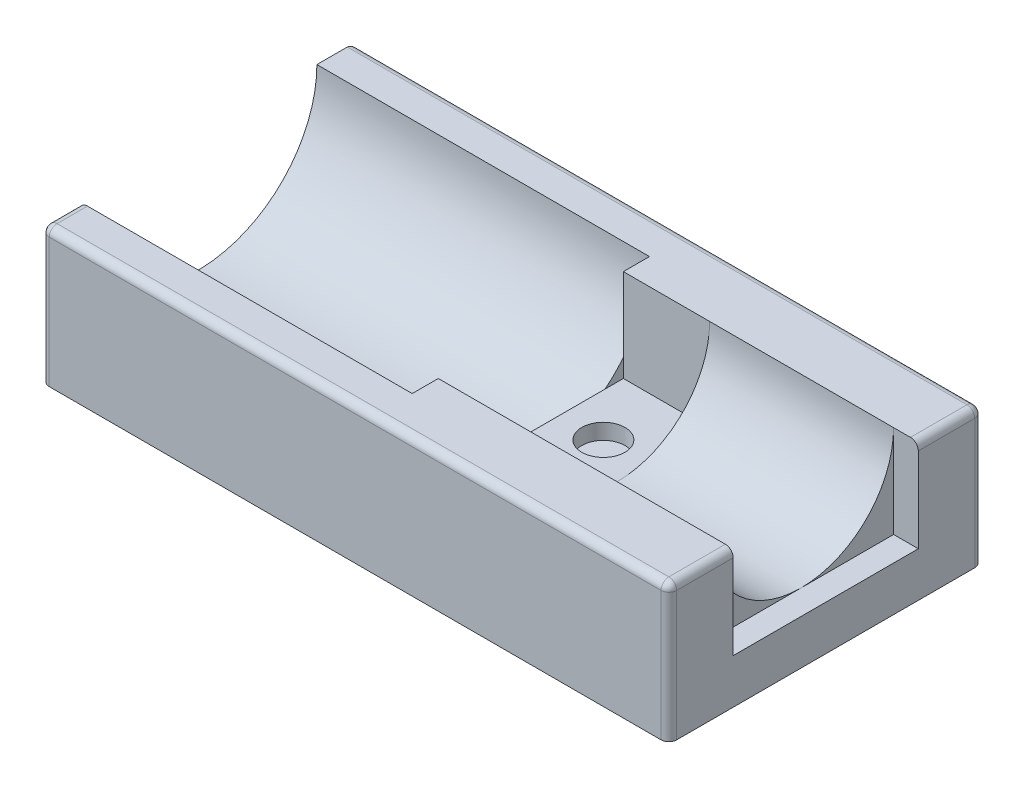
ISO-10303-21;
HEADER;
FILE_DESCRIPTION(('STEP AP214'),'2;1');
FILE_NAME('part.step','',(''),(''),'','','');
FILE_SCHEMA(('AUTOMOTIVE_DESIGN { 1 0 10303 214 1 1 1 1 }'));
ENDSEC;
DATA;
#1=APPLICATION_CONTEXT('core data for automotive mechanical design processes');
#2=APPLICATION_PROTOCOL_DEFINITION('international standard','automotive_design',2000,#1);
#3=PRODUCT_CONTEXT('',#1,'mechanical');
#4=PRODUCT('Part','Part','',(#3));
#5=PRODUCT_RELATED_PRODUCT_CATEGORY('part','',(#4));
#6=PRODUCT_DEFINITION_FORMATION('','',#4);
#7=PRODUCT_DEFINITION_CONTEXT('part definition',#1,'design');
#8=PRODUCT_DEFINITION('design','',#6,#7);
#9=PRODUCT_DEFINITION_SHAPE('','',#8);
#10=(LENGTH_UNIT() NAMED_UNIT(*) SI_UNIT(.MILLI.,.METRE.));
#11=(NAMED_UNIT(*) PLANE_ANGLE_UNIT() SI_UNIT($,.RADIAN.));
#12=(NAMED_UNIT(*) SI_UNIT($,.STERADIAN.) SOLID_ANGLE_UNIT());
#13=UNCERTAINTY_MEASURE_WITH_UNIT(LENGTH_MEASURE(1.E-05),#10,'distance_accuracy_value','');
#14=(GEOMETRIC_REPRESENTATION_CONTEXT(3) GLOBAL_UNCERTAINTY_ASSIGNED_CONTEXT((#13)) GLOBAL_UNIT_ASSIGNED_CONTEXT((#10,
#11,#12)) REPRESENTATION_CONTEXT('',''));
#15=CARTESIAN_POINT('',(0.,0.,0.));
#16=DIRECTION('',(0.,0.,1.));
#17=DIRECTION('',(1.,0.,0.));
#18=AXIS2_PLACEMENT_3D('',#15,#16,#17);
#19=CARTESIAN_POINT('',(0.,88.9,101.6));
#20=DIRECTION('',(0.,0.,-1.));
#21=DIRECTION('',(-1.,0.,0.));
#22=AXIS2_PLACEMENT_3D('',#19,#20,#21);
#23=PLANE('',#22);
#24=DIRECTION('',(-1.,0.,0.));
#25=VECTOR('',#24,1.);
#26=CARTESIAN_POINT('',(0.,44.45,101.6));
#27=LINE('',#26,#25);
#28=CARTESIAN_POINT('',(200.66,44.45,101.6));
#29=VERTEX_POINT('',#28);
#30=CARTESIAN_POINT('',(2.54000000000001,44.45,101.6));
#31=VERTEX_POINT('',#30);
#32=EDGE_CURVE('E199',#29,#31,#27,.T.);
#33=ORIENTED_EDGE('',*,*,#32,.F.);
#34=DIRECTION('',(0.,-1.,0.));
#35=VECTOR('',#34,1.);
#36=CARTESIAN_POINT('',(200.66,88.9,101.6));
#37=LINE('',#36,#35);
#38=CARTESIAN_POINT('',(200.66,86.36,101.6));
#39=VERTEX_POINT('',#38);
#40=EDGE_CURVE('E260',#29,#39,#37,.F.);
#41=ORIENTED_EDGE('',*,*,#40,.T.);
#42=DIRECTION('',(1.,0.,0.));
#43=VECTOR('',#42,1.);
#44=CARTESIAN_POINT('',(0.,86.36,101.6));
#45=LINE('',#44,#43);
#46=CARTESIAN_POINT('',(2.54000000000001,86.36,101.6));
#47=VERTEX_POINT('',#46);
#48=EDGE_CURVE('E362',#39,#47,#45,.F.);
#49=ORIENTED_EDGE('',*,*,#48,.T.);
#50=DIRECTION('',(0.,-1.,0.));
#51=VECTOR('',#50,1.);
#52=CARTESIAN_POINT('',(2.54000000000001,88.9,101.6));
#53=LINE('',#52,#51);
#54=EDGE_CURVE('E525',#47,#31,#53,.T.);
#55=ORIENTED_EDGE('',*,*,#54,.T.);
#56=EDGE_LOOP('',(#33,#41,#49,#55));
#57=FACE_BOUND('',#56,.T.);
#58=ADVANCED_FACE('F37',(#57),#23,.F.);
#59=CARTESIAN_POINT('',(0.,88.9,0.));
#60=DIRECTION('',(1.,0.,0.));
#61=DIRECTION('',(0.,0.,-1.));
#62=AXIS2_PLACEMENT_3D('',#59,#60,#61);
#63=PLANE('',#62);
#64=DIRECTION('',(0.,0.,-1.));
#65=VECTOR('',#64,1.);
#66=CARTESIAN_POINT('',(0.,44.45,139.7));
#67=LINE('',#66,#65);
#68=CARTESIAN_POINT('',(0.,44.45,99.06));
#69=VERTEX_POINT('',#68);
#70=CARTESIAN_POINT('',(0.,44.45,2.54));
#71=VERTEX_POINT('',#70);
#72=EDGE_CURVE('E52',#69,#71,#67,.T.);
#73=ORIENTED_EDGE('',*,*,#72,.F.);
#74=DIRECTION('',(0.,-1.,0.));
#75=VECTOR('',#74,1.);
#76=CARTESIAN_POINT('',(0.,88.9,99.06));
#77=LINE('',#76,#75);
#78=CARTESIAN_POINT('',(0.,86.36,99.06));
#79=VERTEX_POINT('',#78);
#80=EDGE_CURVE('E209',#69,#79,#77,.F.);
#81=ORIENTED_EDGE('',*,*,#80,.T.);
#82=DIRECTION('',(0.,0.,1.));
#83=VECTOR('',#82,1.);
#84=CARTESIAN_POINT('',(0.,86.36,89.2175));
#85=LINE('',#84,#83);
#86=CARTESIAN_POINT('',(0.,86.36,89.133441095863));
#87=VERTEX_POINT('',#86);
#88=EDGE_CURVE('E220',#79,#87,#85,.F.);
#89=ORIENTED_EDGE('',*,*,#88,.T.);
#90=CARTESIAN_POINT('',(0.,88.9,50.8));
#91=DIRECTION('',(-1.,0.,0.));
#92=DIRECTION('',(0.,0.,1.));
#93=AXIS2_PLACEMENT_3D('',#90,#91,#92);
#94=CIRCLE('',#93,38.4175);
#95=CARTESIAN_POINT('',(0.,88.9,12.3825));
#96=VERTEX_POINT('',#95);
#97=EDGE_CURVE('E401',#96,#87,#94,.T.);
#98=ORIENTED_EDGE('',*,*,#97,.F.);
#99=DIRECTION('',(0.,0.,1.));
#100=VECTOR('',#99,1.);
#101=CARTESIAN_POINT('',(0.,88.9,0.));
#102=LINE('',#101,#100);
#103=CARTESIAN_POINT('',(0.,88.9,2.54));
#104=VERTEX_POINT('',#103);
#105=EDGE_CURVE('E478',#104,#96,#102,.T.);
#106=ORIENTED_EDGE('',*,*,#105,.F.);
#107=DIRECTION('',(0.,-1.,0.));
#108=VECTOR('',#107,1.);
#109=CARTESIAN_POINT('',(0.,88.9,2.54));
#110=LINE('',#109,#108);
#111=EDGE_CURVE('E213',#104,#71,#110,.T.);
#112=ORIENTED_EDGE('',*,*,#111,.T.);
#113=EDGE_LOOP('',(#73,#81,#89,#98,#106,#112));
#114=FACE_BOUND('',#113,.T.);
#115=ADVANCED_FACE('F208',(#114),#63,.F.);
#116=CARTESIAN_POINT('',(203.2,88.9,0.));
#117=DIRECTION('',(-1.,0.,0.));
#118=DIRECTION('',(0.,0.,1.));
#119=AXIS2_PLACEMENT_3D('',#116,#117,#118);
#120=PLANE('',#119);
#121=DIRECTION('',(0.,0.,1.));
#122=VECTOR('',#121,1.);
#123=CARTESIAN_POINT('',(203.2,44.45,139.7));
#124=LINE('',#123,#122);
#125=CARTESIAN_POINT('',(203.2,44.45,2.54));
#126=VERTEX_POINT('',#125);
#127=CARTESIAN_POINT('',(203.2,44.45,99.06));
#128=VERTEX_POINT('',#127);
#129=EDGE_CURVE('E557',#126,#128,#124,.T.);
#130=ORIENTED_EDGE('',*,*,#129,.F.);
#131=DIRECTION('',(0.,-1.,0.));
#132=VECTOR('',#131,1.);
#133=CARTESIAN_POINT('',(203.2,88.9,2.54));
#134=LINE('',#133,#132);
#135=CARTESIAN_POINT('',(203.2,86.36,2.54));
#136=VERTEX_POINT('',#135);
#137=EDGE_CURVE('E237',#126,#136,#134,.F.);
#138=ORIENTED_EDGE('',*,*,#137,.T.);
#139=DIRECTION('',(0.,0.,-1.));
#140=VECTOR('',#139,1.);
#141=CARTESIAN_POINT('',(203.2,86.36,20.828));
#142=LINE('',#141,#140);
#143=CARTESIAN_POINT('',(203.2,86.36,20.828));
#144=VERTEX_POINT('',#143);
#145=EDGE_CURVE('E235',#136,#144,#142,.F.);
#146=ORIENTED_EDGE('',*,*,#145,.T.);
#147=DIRECTION('',(0.,1.,0.));
#148=VECTOR('',#147,1.);
#149=CARTESIAN_POINT('',(203.2,118.872,20.828));
#150=LINE('',#149,#148);
#151=CARTESIAN_POINT('',(203.2,58.928,20.828));
#152=VERTEX_POINT('',#151);
#153=EDGE_CURVE('E462',#152,#144,#150,.T.);
#154=ORIENTED_EDGE('',*,*,#153,.F.);
#155=DIRECTION('',(0.,0.,-1.));
#156=VECTOR('',#155,1.);
#157=CARTESIAN_POINT('',(203.2,58.928,20.828));
#158=LINE('',#157,#156);
#159=CARTESIAN_POINT('',(203.2,58.928,80.772));
#160=VERTEX_POINT('',#159);
#161=EDGE_CURVE('E471',#160,#152,#158,.T.);
#162=ORIENTED_EDGE('',*,*,#161,.F.);
#163=DIRECTION('',(0.,-1.,0.));
#164=VECTOR('',#163,1.);
#165=CARTESIAN_POINT('',(203.2,118.872,80.772));
#166=LINE('',#165,#164);
#167=CARTESIAN_POINT('',(203.2,86.36,80.772));
#168=VERTEX_POINT('',#167);
#169=EDGE_CURVE('E451',#168,#160,#166,.T.);
#170=ORIENTED_EDGE('',*,*,#169,.F.);
#171=DIRECTION('',(0.,0.,-1.));
#172=VECTOR('',#171,1.);
#173=CARTESIAN_POINT('',(203.2,86.36,101.6));
#174=LINE('',#173,#172);
#175=CARTESIAN_POINT('',(203.2,86.36,99.06));
#176=VERTEX_POINT('',#175);
#177=EDGE_CURVE('E233',#168,#176,#174,.F.);
#178=ORIENTED_EDGE('',*,*,#177,.T.);
#179=DIRECTION('',(0.,-1.,0.));
#180=VECTOR('',#179,1.);
#181=CARTESIAN_POINT('',(203.2,88.9,99.06));
#182=LINE('',#181,#180);
#183=EDGE_CURVE('E230',#176,#128,#182,.T.);
#184=ORIENTED_EDGE('',*,*,#183,.T.);
#185=EDGE_LOOP('',(#130,#138,#146,#154,#162,#170,#178,#184));
#186=FACE_BOUND('',#185,.T.);
#187=ADVANCED_FACE('F328',(#186),#120,.F.);
#188=CARTESIAN_POINT('',(0.,88.9,0.));
#189=DIRECTION('',(0.,0.,1.));
#190=DIRECTION('',(1.,0.,0.));
#191=AXIS2_PLACEMENT_3D('',#188,#189,#190);
#192=PLANE('',#191);
#193=DIRECTION('',(1.,0.,0.));
#194=VECTOR('',#193,1.);
#195=CARTESIAN_POINT('',(0.,44.45,0.));
#196=LINE('',#195,#194);
#197=CARTESIAN_POINT('',(2.54,44.45,0.));
#198=VERTEX_POINT('',#197);
#199=CARTESIAN_POINT('',(200.66,44.45,0.));
#200=VERTEX_POINT('',#199);
#201=EDGE_CURVE('E214',#198,#200,#196,.T.);
#202=ORIENTED_EDGE('',*,*,#201,.F.);
#203=DIRECTION('',(0.,-1.,0.));
#204=VECTOR('',#203,1.);
#205=CARTESIAN_POINT('',(2.54,88.9,0.));
#206=LINE('',#205,#204);
#207=CARTESIAN_POINT('',(2.54,86.36,0.));
#208=VERTEX_POINT('',#207);
#209=EDGE_CURVE('E244',#198,#208,#206,.F.);
#210=ORIENTED_EDGE('',*,*,#209,.T.);
#211=DIRECTION('',(-1.,0.,0.));
#212=VECTOR('',#211,1.);
#213=CARTESIAN_POINT('',(203.2,86.36,0.));
#214=LINE('',#213,#212);
#215=CARTESIAN_POINT('',(200.66,86.36,0.));
#216=VERTEX_POINT('',#215);
#217=EDGE_CURVE('E242',#208,#216,#214,.F.);
#218=ORIENTED_EDGE('',*,*,#217,.T.);
#219=DIRECTION('',(0.,-1.,0.));
#220=VECTOR('',#219,1.);
#221=CARTESIAN_POINT('',(200.66,88.9,0.));
#222=LINE('',#221,#220);
#223=EDGE_CURVE('E239',#216,#200,#222,.T.);
#224=ORIENTED_EDGE('',*,*,#223,.T.);
#225=EDGE_LOOP('',(#202,#210,#218,#224));
#226=FACE_BOUND('',#225,.T.);
#227=ADVANCED_FACE('F324',(#226),#192,.F.);
#228=CARTESIAN_POINT('',(200.66,88.9,99.06));
#229=DIRECTION('',(0.,-1.,0.));
#230=DIRECTION('',(0.,0.,-1.));
#231=AXIS2_PLACEMENT_3D('',#228,#229,#230);
#232=CYLINDRICAL_SURFACE('',#231,2.54);
#233=ORIENTED_EDGE('',*,*,#40,.F.);
#234=CARTESIAN_POINT('',(200.66,44.45,99.06));
#235=DIRECTION('',(0.,-1.,0.));
#236=DIRECTION('',(0.,0.,-1.));
#237=AXIS2_PLACEMENT_3D('',#234,#235,#236);
#238=CIRCLE('',#237,2.54);
#239=EDGE_CURVE('E380',#29,#128,#238,.F.);
#240=ORIENTED_EDGE('',*,*,#239,.T.);
#241=ORIENTED_EDGE('',*,*,#183,.F.);
#242=CARTESIAN_POINT('',(200.66,86.36,99.06));
#243=DIRECTION('',(0.,1.,0.));
#244=DIRECTION('',(0.,0.,1.));
#245=AXIS2_PLACEMENT_3D('',#242,#243,#244);
#246=CIRCLE('',#245,2.54);
#247=EDGE_CURVE('E367',#176,#39,#246,.F.);
#248=ORIENTED_EDGE('',*,*,#247,.T.);
#249=EDGE_LOOP('',(#233,#240,#241,#248));
#250=FACE_BOUND('',#249,.T.);
#251=ADVANCED_FACE('F327',(#250),#232,.T.);
#252=CARTESIAN_POINT('',(2.54000000000001,88.9,99.06));
#253=DIRECTION('',(0.,-1.,0.));
#254=DIRECTION('',(0.,0.,-1.));
#255=AXIS2_PLACEMENT_3D('',#252,#253,#254);
#256=CYLINDRICAL_SURFACE('',#255,2.54);
#257=ORIENTED_EDGE('',*,*,#80,.F.);
#258=CARTESIAN_POINT('',(2.54000000000001,44.45,99.06));
#259=DIRECTION('',(0.,-1.,0.));
#260=DIRECTION('',(0.,0.,-1.));
#261=AXIS2_PLACEMENT_3D('',#258,#259,#260);
#262=CIRCLE('',#261,2.54);
#263=EDGE_CURVE('E196',#69,#31,#262,.F.);
#264=ORIENTED_EDGE('',*,*,#263,.T.);
#265=ORIENTED_EDGE('',*,*,#54,.F.);
#266=CARTESIAN_POINT('',(2.54000000000001,86.36,99.06));
#267=DIRECTION('',(0.,1.,0.));
#268=DIRECTION('',(0.,0.,1.));
#269=AXIS2_PLACEMENT_3D('',#266,#267,#268);
#270=CIRCLE('',#269,2.54);
#271=EDGE_CURVE('E219',#47,#79,#270,.F.);
#272=ORIENTED_EDGE('',*,*,#271,.T.);
#273=EDGE_LOOP('',(#257,#264,#265,#272));
#274=FACE_BOUND('',#273,.T.);
#275=ADVANCED_FACE('F217',(#274),#256,.T.);
#276=CARTESIAN_POINT('',(200.66,88.9,2.54));
#277=DIRECTION('',(0.,-1.,0.));
#278=DIRECTION('',(0.,0.,-1.));
#279=AXIS2_PLACEMENT_3D('',#276,#277,#278);
#280=CYLINDRICAL_SURFACE('',#279,2.54);
#281=ORIENTED_EDGE('',*,*,#137,.F.);
#282=CARTESIAN_POINT('',(200.66,44.45,2.54));
#283=DIRECTION('',(0.,-1.,0.));
#284=DIRECTION('',(0.,0.,-1.));
#285=AXIS2_PLACEMENT_3D('',#282,#283,#284);
#286=CIRCLE('',#285,2.54);
#287=EDGE_CURVE('E204',#126,#200,#286,.F.);
#288=ORIENTED_EDGE('',*,*,#287,.T.);
#289=ORIENTED_EDGE('',*,*,#223,.F.);
#290=CARTESIAN_POINT('',(200.66,86.36,2.54));
#291=DIRECTION('',(0.,1.,0.));
#292=DIRECTION('',(0.,0.,1.));
#293=AXIS2_PLACEMENT_3D('',#290,#291,#292);
#294=CIRCLE('',#293,2.54);
#295=EDGE_CURVE('E385',#136,#216,#294,.T.);
#296=ORIENTED_EDGE('',*,*,#295,.F.);
#297=EDGE_LOOP('',(#281,#288,#289,#296));
#298=FACE_BOUND('',#297,.T.);
#299=ADVANCED_FACE('F39',(#298),#280,.T.);
#300=CARTESIAN_POINT('',(2.54,88.9,2.54));
#301=DIRECTION('',(0.,-1.,0.));
#302=DIRECTION('',(0.,0.,-1.));
#303=AXIS2_PLACEMENT_3D('',#300,#301,#302);
#304=CYLINDRICAL_SURFACE('',#303,2.54);
#305=ORIENTED_EDGE('',*,*,#209,.F.);
#306=CARTESIAN_POINT('',(2.54,44.45,2.54));
#307=DIRECTION('',(0.,-1.,0.));
#308=DIRECTION('',(0.,0.,-1.));
#309=AXIS2_PLACEMENT_3D('',#306,#307,#308);
#310=CIRCLE('',#309,2.54);
#311=EDGE_CURVE('E11',#198,#71,#310,.F.);
#312=ORIENTED_EDGE('',*,*,#311,.T.);
#313=ORIENTED_EDGE('',*,*,#111,.F.);
#314=CARTESIAN_POINT('',(2.54,86.36,2.54));
#315=DIRECTION('',(0.707106781186547,0.707106781186547,0.));
#316=DIRECTION('',(0.707106781186547,-0.707106781186547,0.));
#317=AXIS2_PLACEMENT_3D('',#314,#315,#316);
#318=ELLIPSE('',#317,3.59210244842766,2.54);
#319=EDGE_CURVE('E376',#104,#208,#318,.F.);
#320=ORIENTED_EDGE('',*,*,#319,.T.);
#321=EDGE_LOOP('',(#305,#312,#313,#320));
#322=FACE_BOUND('',#321,.T.);
#323=ADVANCED_FACE('F320',(#322),#304,.T.);
#324=CARTESIAN_POINT('',(0.,88.9,50.8));
#325=DIRECTION('',(1.,0.,0.));
#326=DIRECTION('',(0.,0.,-1.));
#327=AXIS2_PLACEMENT_3D('',#324,#325,#326);
#328=CYLINDRICAL_SURFACE('',#327,29.972);
#329=CARTESIAN_POINT('',(135.636,88.9,50.8));
#330=DIRECTION('',(-1.,0.,0.));
#331=DIRECTION('',(0.,0.,1.));
#332=AXIS2_PLACEMENT_3D('',#329,#330,#331);
#333=CIRCLE('',#332,29.972);
#334=CARTESIAN_POINT('',(135.636,88.9,80.772));
#335=VERTEX_POINT('',#334);
#336=CARTESIAN_POINT('',(135.636,58.928,50.8));
#337=VERTEX_POINT('',#336);
#338=EDGE_CURVE('E221',#335,#337,#333,.F.);
#339=ORIENTED_EDGE('',*,*,#338,.F.);
#340=DIRECTION('',(1.,0.,0.));
#341=VECTOR('',#340,1.);
#342=CARTESIAN_POINT('',(0.,88.9,80.772));
#343=LINE('',#342,#341);
#344=CARTESIAN_POINT('',(195.199,88.9,80.772));
#345=VERTEX_POINT('',#344);
#346=EDGE_CURVE('E486',#335,#345,#343,.T.);
#347=ORIENTED_EDGE('',*,*,#346,.T.);
#348=CARTESIAN_POINT('',(195.199,88.9,50.8));
#349=DIRECTION('',(-1.,0.,0.));
#350=DIRECTION('',(0.,0.,1.));
#351=AXIS2_PLACEMENT_3D('',#348,#349,#350);
#352=CIRCLE('',#351,29.972);
#353=CARTESIAN_POINT('',(195.199,58.928,50.8));
#354=VERTEX_POINT('',#353);
#355=EDGE_CURVE('E489',#345,#354,#352,.F.);
#356=ORIENTED_EDGE('',*,*,#355,.T.);
#357=CARTESIAN_POINT('',(195.199,88.9,20.828));
#358=VERTEX_POINT('',#357);
#359=EDGE_CURVE('E487',#354,#358,#352,.F.);
#360=ORIENTED_EDGE('',*,*,#359,.T.);
#361=DIRECTION('',(1.,0.,0.));
#362=VECTOR('',#361,1.);
#363=CARTESIAN_POINT('',(0.,88.9,20.828));
#364=LINE('',#363,#362);
#365=CARTESIAN_POINT('',(135.636,88.9,20.828));
#366=VERTEX_POINT('',#365);
#367=EDGE_CURVE('E482',#358,#366,#364,.F.);
#368=ORIENTED_EDGE('',*,*,#367,.T.);
#369=EDGE_CURVE('E225',#337,#366,#333,.F.);
#370=ORIENTED_EDGE('',*,*,#369,.F.);
#371=EDGE_LOOP('',(#339,#347,#356,#360,#368,#370));
#372=FACE_BOUND('',#371,.T.);
#373=ADVANCED_FACE('F316',(#372),#328,.F.);
#374=CARTESIAN_POINT('',(0.,88.9,0.));
#375=DIRECTION('',(0.,1.,0.));
#376=DIRECTION('',(0.,0.,1.));
#377=AXIS2_PLACEMENT_3D('',#374,#375,#376);
#378=PLANE('',#377);
#379=DIRECTION('',(-1.,0.,0.));
#380=VECTOR('',#379,1.);
#381=CARTESIAN_POINT('',(107.696,88.9,89.2175));
#382=LINE('',#381,#380);
#383=CARTESIAN_POINT('',(2.54000000000001,88.9,89.2175));
#384=VERTEX_POINT('',#383);
#385=CARTESIAN_POINT('',(107.696,88.9,89.2175));
#386=VERTEX_POINT('',#385);
#387=EDGE_CURVE('E425',#384,#386,#382,.F.);
#388=ORIENTED_EDGE('',*,*,#387,.F.);
#389=DIRECTION('',(0.,0.,1.));
#390=VECTOR('',#389,1.);
#391=CARTESIAN_POINT('',(2.54000000000001,88.9,101.6));
#392=LINE('',#391,#390);
#393=CARTESIAN_POINT('',(2.54000000000001,88.9,99.06));
#394=VERTEX_POINT('',#393);
#395=EDGE_CURVE('E250',#384,#394,#392,.T.);
#396=ORIENTED_EDGE('',*,*,#395,.T.);
#397=DIRECTION('',(1.,0.,0.));
#398=VECTOR('',#397,1.);
#399=CARTESIAN_POINT('',(203.2,88.9,99.06));
#400=LINE('',#399,#398);
#401=CARTESIAN_POINT('',(200.66,88.9,99.06));
#402=VERTEX_POINT('',#401);
#403=EDGE_CURVE('E246',#394,#402,#400,.T.);
#404=ORIENTED_EDGE('',*,*,#403,.T.);
#405=DIRECTION('',(0.,0.,-1.));
#406=VECTOR('',#405,1.);
#407=CARTESIAN_POINT('',(200.66,88.9,80.772));
#408=LINE('',#407,#406);
#409=CARTESIAN_POINT('',(200.66,88.9,80.772));
#410=VERTEX_POINT('',#409);
#411=EDGE_CURVE('E248',#402,#410,#408,.T.);
#412=ORIENTED_EDGE('',*,*,#411,.T.);
#413=EDGE_CURVE('E485',#345,#410,#343,.T.);
#414=ORIENTED_EDGE('',*,*,#413,.F.);
#415=ORIENTED_EDGE('',*,*,#346,.F.);
#416=DIRECTION('',(1.,0.,0.));
#417=VECTOR('',#416,1.);
#418=CARTESIAN_POINT('',(107.696,88.9,80.772));
#419=LINE('',#418,#417);
#420=CARTESIAN_POINT('',(107.696,88.9,80.772));
#421=VERTEX_POINT('',#420);
#422=EDGE_CURVE('E449',#421,#335,#419,.T.);
#423=ORIENTED_EDGE('',*,*,#422,.F.);
#424=DIRECTION('',(0.,0.,1.));
#425=VECTOR('',#424,1.);
#426=CARTESIAN_POINT('',(107.696,88.9,0.));
#427=LINE('',#426,#425);
#428=EDGE_CURVE('E418',#421,#386,#427,.T.);
#429=ORIENTED_EDGE('',*,*,#428,.T.);
#430=EDGE_LOOP('',(#388,#396,#404,#412,#414,#415,#423,#429));
#431=FACE_BOUND('',#430,.T.);
#432=ADVANCED_FACE('F319',(#431),#378,.T.);
#433=DIRECTION('',(0.,0.,-1.));
#434=VECTOR('',#433,1.);
#435=CARTESIAN_POINT('',(200.66,88.9,0.));
#436=LINE('',#435,#434);
#437=CARTESIAN_POINT('',(200.66,88.9,20.828));
#438=VERTEX_POINT('',#437);
#439=CARTESIAN_POINT('',(200.66,88.9,2.54));
#440=VERTEX_POINT('',#439);
#441=EDGE_CURVE('E59',#438,#440,#436,.T.);
#442=ORIENTED_EDGE('',*,*,#441,.T.);
#443=DIRECTION('',(-1.,0.,0.));
#444=VECTOR('',#443,1.);
#445=CARTESIAN_POINT('',(0.,88.9,2.54));
#446=LINE('',#445,#444);
#447=EDGE_CURVE('E520',#440,#104,#446,.T.);
#448=ORIENTED_EDGE('',*,*,#447,.T.);
#449=ORIENTED_EDGE('',*,*,#105,.T.);
#450=DIRECTION('',(-1.,0.,0.));
#451=VECTOR('',#450,1.);
#452=CARTESIAN_POINT('',(107.696,88.9,12.3825));
#453=LINE('',#452,#451);
#454=CARTESIAN_POINT('',(107.696,88.9,12.3825));
#455=VERTEX_POINT('',#454);
#456=EDGE_CURVE('E406',#455,#96,#453,.T.);
#457=ORIENTED_EDGE('',*,*,#456,.F.);
#458=DIRECTION('',(0.,0.,1.));
#459=VECTOR('',#458,1.);
#460=CARTESIAN_POINT('',(107.696,88.9,0.));
#461=LINE('',#460,#459);
#462=CARTESIAN_POINT('',(107.696,88.9,20.828));
#463=VERTEX_POINT('',#462);
#464=EDGE_CURVE('E421',#455,#463,#461,.T.);
#465=ORIENTED_EDGE('',*,*,#464,.T.);
#466=DIRECTION('',(1.,0.,0.));
#467=VECTOR('',#466,1.);
#468=CARTESIAN_POINT('',(107.696,88.9,20.828));
#469=LINE('',#468,#467);
#470=EDGE_CURVE('E452',#463,#366,#469,.T.);
#471=ORIENTED_EDGE('',*,*,#470,.T.);
#472=ORIENTED_EDGE('',*,*,#367,.F.);
#473=EDGE_CURVE('E483',#438,#358,#364,.F.);
#474=ORIENTED_EDGE('',*,*,#473,.F.);
#475=EDGE_LOOP('',(#442,#448,#449,#457,#465,#471,#472,#474));
#476=FACE_BOUND('',#475,.T.);
#477=ADVANCED_FACE('F314',(#476),#378,.T.);
#478=CARTESIAN_POINT('',(195.199,118.872,80.772));
#479=DIRECTION('',(0.,0.,1.));
#480=DIRECTION('',(1.,0.,0.));
#481=AXIS2_PLACEMENT_3D('',#478,#479,#480);
#482=PLANE('',#481);
#483=ORIENTED_EDGE('',*,*,#413,.T.);
#484=CARTESIAN_POINT('',(200.66,86.36,80.772));
#485=DIRECTION('',(0.,0.,1.));
#486=DIRECTION('',(1.,0.,0.));
#487=AXIS2_PLACEMENT_3D('',#484,#485,#486);
#488=CIRCLE('',#487,2.54);
#489=EDGE_CURVE('E45',#410,#168,#488,.F.);
#490=ORIENTED_EDGE('',*,*,#489,.T.);
#491=ORIENTED_EDGE('',*,*,#169,.T.);
#492=DIRECTION('',(1.,0.,0.));
#493=VECTOR('',#492,1.);
#494=CARTESIAN_POINT('',(195.199,58.928,80.772));
#495=LINE('',#494,#493);
#496=CARTESIAN_POINT('',(195.199,58.928,80.772));
#497=VERTEX_POINT('',#496);
#498=EDGE_CURVE('E469',#497,#160,#495,.T.);
#499=ORIENTED_EDGE('',*,*,#498,.F.);
#500=DIRECTION('',(0.,-1.,0.));
#501=VECTOR('',#500,1.);
#502=CARTESIAN_POINT('',(195.199,118.872,80.772));
#503=LINE('',#502,#501);
#504=EDGE_CURVE('E459',#345,#497,#503,.T.);
#505=ORIENTED_EDGE('',*,*,#504,.F.);
#506=EDGE_LOOP('',(#483,#490,#491,#499,#505));
#507=FACE_BOUND('',#506,.T.);
#508=ADVANCED_FACE('F310',(#507),#482,.F.);
#509=CARTESIAN_POINT('',(195.199,58.928,20.828));
#510=DIRECTION('',(0.,-1.,0.));
#511=DIRECTION('',(0.,0.,-1.));
#512=AXIS2_PLACEMENT_3D('',#509,#510,#511);
#513=PLANE('',#512);
#514=ORIENTED_EDGE('',*,*,#161,.T.);
#515=DIRECTION('',(1.,0.,0.));
#516=VECTOR('',#515,1.);
#517=CARTESIAN_POINT('',(195.199,58.928,20.828));
#518=LINE('',#517,#516);
#519=CARTESIAN_POINT('',(195.199,58.928,20.828));
#520=VERTEX_POINT('',#519);
#521=EDGE_CURVE('E475',#520,#152,#518,.T.);
#522=ORIENTED_EDGE('',*,*,#521,.F.);
#523=DIRECTION('',(0.,0.,-1.));
#524=VECTOR('',#523,1.);
#525=CARTESIAN_POINT('',(195.199,58.928,20.828));
#526=LINE('',#525,#524);
#527=EDGE_CURVE('E461',#354,#520,#526,.T.);
#528=ORIENTED_EDGE('',*,*,#527,.F.);
#529=EDGE_CURVE('E463',#497,#354,#526,.T.);
#530=ORIENTED_EDGE('',*,*,#529,.F.);
#531=ORIENTED_EDGE('',*,*,#498,.T.);
#532=EDGE_LOOP('',(#514,#522,#528,#530,#531));
#533=FACE_BOUND('',#532,.T.);
#534=ADVANCED_FACE('F303',(#533),#513,.F.);
#535=CARTESIAN_POINT('',(195.199,0.,0.));
#536=DIRECTION('',(-1.,0.,0.));
#537=DIRECTION('',(0.,0.,1.));
#538=AXIS2_PLACEMENT_3D('',#535,#536,#537);
#539=PLANE('',#538);
#540=ORIENTED_EDGE('',*,*,#504,.T.);
#541=ORIENTED_EDGE('',*,*,#529,.T.);
#542=ORIENTED_EDGE('',*,*,#355,.F.);
#543=EDGE_LOOP('',(#540,#541,#542));
#544=FACE_BOUND('',#543,.T.);
#545=ADVANCED_FACE('F299',(#544),#539,.F.);
#546=ORIENTED_EDGE('',*,*,#527,.T.);
#547=DIRECTION('',(0.,1.,0.));
#548=VECTOR('',#547,1.);
#549=CARTESIAN_POINT('',(195.199,118.872,20.828));
#550=LINE('',#549,#548);
#551=EDGE_CURVE('E466',#520,#358,#550,.T.);
#552=ORIENTED_EDGE('',*,*,#551,.T.);
#553=ORIENTED_EDGE('',*,*,#359,.F.);
#554=EDGE_LOOP('',(#546,#552,#553));
#555=FACE_BOUND('',#554,.T.);
#556=ADVANCED_FACE('F302',(#555),#539,.F.);
#557=CARTESIAN_POINT('',(195.199,118.872,20.828));
#558=DIRECTION('',(0.,0.,-1.));
#559=DIRECTION('',(0.,1.,0.));
#560=AXIS2_PLACEMENT_3D('',#557,#558,#559);
#561=PLANE('',#560);
#562=ORIENTED_EDGE('',*,*,#153,.T.);
#563=CARTESIAN_POINT('',(200.66,86.36,20.828));
#564=DIRECTION('',(0.,0.,-1.));
#565=DIRECTION('',(0.,1.,0.));
#566=AXIS2_PLACEMENT_3D('',#563,#564,#565);
#567=CIRCLE('',#566,2.54);
#568=EDGE_CURVE('E519',#144,#438,#567,.F.);
#569=ORIENTED_EDGE('',*,*,#568,.T.);
#570=ORIENTED_EDGE('',*,*,#473,.T.);
#571=ORIENTED_EDGE('',*,*,#551,.F.);
#572=ORIENTED_EDGE('',*,*,#521,.T.);
#573=EDGE_LOOP('',(#562,#569,#570,#571,#572));
#574=FACE_BOUND('',#573,.T.);
#575=ADVANCED_FACE('F294',(#574),#561,.F.);
#576=CARTESIAN_POINT('',(107.696,58.928,80.772));
#577=DIRECTION('',(0.,-1.,0.));
#578=DIRECTION('',(0.,0.,-1.));
#579=AXIS2_PLACEMENT_3D('',#576,#577,#578);
#580=PLANE('',#579);
#581=CARTESIAN_POINT('',(121.666,58.928,41.275));
#582=DIRECTION('',(0.,1.,0.));
#583=DIRECTION('',(0.,0.,1.));
#584=AXIS2_PLACEMENT_3D('',#581,#582,#583);
#585=CIRCLE('',#584,6.98499999999998);
#586=CARTESIAN_POINT('',(121.666,58.928,48.26));
#587=VERTEX_POINT('',#586);
#588=EDGE_CURVE('E369',#587,#587,#585,.T.);
#589=ORIENTED_EDGE('',*,*,#588,.F.);
#590=EDGE_LOOP('',(#589));
#591=FACE_BOUND('',#590,.T.);
#592=DIRECTION('',(0.,0.,-1.));
#593=VECTOR('',#592,1.);
#594=CARTESIAN_POINT('',(135.636,58.928,80.772));
#595=LINE('',#594,#593);
#596=CARTESIAN_POINT('',(135.636,58.928,20.828));
#597=VERTEX_POINT('',#596);
#598=EDGE_CURVE('E443',#337,#597,#595,.T.);
#599=ORIENTED_EDGE('',*,*,#598,.T.);
#600=DIRECTION('',(1.,0.,0.));
#601=VECTOR('',#600,1.);
#602=CARTESIAN_POINT('',(107.696,58.928,20.828));
#603=LINE('',#602,#601);
#604=CARTESIAN_POINT('',(107.696,58.928,20.828));
#605=VERTEX_POINT('',#604);
#606=EDGE_CURVE('E455',#605,#597,#603,.T.);
#607=ORIENTED_EDGE('',*,*,#606,.F.);
#608=DIRECTION('',(0.,0.,-1.));
#609=VECTOR('',#608,1.);
#610=CARTESIAN_POINT('',(107.696,58.928,80.772));
#611=LINE('',#610,#609);
#612=CARTESIAN_POINT('',(107.696,58.928,26.7670325958278));
#613=VERTEX_POINT('',#612);
#614=EDGE_CURVE('E430',#613,#605,#611,.T.);
#615=ORIENTED_EDGE('',*,*,#614,.F.);
#616=CARTESIAN_POINT('',(107.696,58.928,74.8329674041721));
#617=VERTEX_POINT('',#616);
#618=EDGE_CURVE('E436',#617,#613,#611,.T.);
#619=ORIENTED_EDGE('',*,*,#618,.F.);
#620=CARTESIAN_POINT('',(107.696,58.928,80.772));
#621=VERTEX_POINT('',#620);
#622=EDGE_CURVE('E432',#621,#617,#611,.T.);
#623=ORIENTED_EDGE('',*,*,#622,.F.);
#624=DIRECTION('',(1.,0.,0.));
#625=VECTOR('',#624,1.);
#626=CARTESIAN_POINT('',(107.696,58.928,80.772));
#627=LINE('',#626,#625);
#628=CARTESIAN_POINT('',(135.636,58.928,80.772));
#629=VERTEX_POINT('',#628);
#630=EDGE_CURVE('E440',#621,#629,#627,.T.);
#631=ORIENTED_EDGE('',*,*,#630,.T.);
#632=EDGE_CURVE('E444',#629,#337,#595,.T.);
#633=ORIENTED_EDGE('',*,*,#632,.T.);
#634=EDGE_LOOP('',(#599,#607,#615,#619,#623,#631,#633));
#635=FACE_BOUND('',#634,.T.);
#636=ADVANCED_FACE('F280',(#591,#635),#580,.F.);
#637=CARTESIAN_POINT('',(107.696,0.,0.));
#638=DIRECTION('',(-1.,0.,0.));
#639=DIRECTION('',(0.,0.,1.));
#640=AXIS2_PLACEMENT_3D('',#637,#638,#639);
#641=PLANE('',#640);
#642=ORIENTED_EDGE('',*,*,#622,.T.);
#643=CARTESIAN_POINT('',(107.696,88.9,50.8));
#644=DIRECTION('',(-1.,0.,0.));
#645=DIRECTION('',(0.,0.,1.));
#646=AXIS2_PLACEMENT_3D('',#643,#644,#645);
#647=CIRCLE('',#646,38.4175);
#648=CARTESIAN_POINT('',(107.696,64.8670325958279,80.772));
#649=VERTEX_POINT('',#648);
#650=EDGE_CURVE('E411',#617,#649,#647,.T.);
#651=ORIENTED_EDGE('',*,*,#650,.T.);
#652=DIRECTION('',(0.,-1.,0.));
#653=VECTOR('',#652,1.);
#654=CARTESIAN_POINT('',(107.696,58.928,80.772));
#655=LINE('',#654,#653);
#656=EDGE_CURVE('E431',#649,#621,#655,.T.);
#657=ORIENTED_EDGE('',*,*,#656,.T.);
#658=EDGE_LOOP('',(#642,#651,#657));
#659=FACE_BOUND('',#658,.T.);
#660=ADVANCED_FACE('F276',(#659),#641,.F.);
#661=DIRECTION('',(0.,1.,0.));
#662=VECTOR('',#661,1.);
#663=CARTESIAN_POINT('',(107.696,58.928,20.828));
#664=LINE('',#663,#662);
#665=CARTESIAN_POINT('',(107.696,64.8670325958278,20.828));
#666=VERTEX_POINT('',#665);
#667=EDGE_CURVE('E437',#605,#666,#664,.T.);
#668=ORIENTED_EDGE('',*,*,#667,.T.);
#669=EDGE_CURVE('E580',#666,#613,#647,.T.);
#670=ORIENTED_EDGE('',*,*,#669,.T.);
#671=ORIENTED_EDGE('',*,*,#614,.T.);
#672=EDGE_LOOP('',(#668,#670,#671));
#673=FACE_BOUND('',#672,.T.);
#674=ADVANCED_FACE('F279',(#673),#641,.F.);
#675=CARTESIAN_POINT('',(135.636,0.,0.));
#676=DIRECTION('',(-1.,0.,0.));
#677=DIRECTION('',(0.,0.,1.));
#678=AXIS2_PLACEMENT_3D('',#675,#676,#677);
#679=PLANE('',#678);
#680=ORIENTED_EDGE('',*,*,#338,.T.);
#681=ORIENTED_EDGE('',*,*,#632,.F.);
#682=DIRECTION('',(0.,-1.,0.));
#683=VECTOR('',#682,1.);
#684=CARTESIAN_POINT('',(135.636,58.928,80.772));
#685=LINE('',#684,#683);
#686=EDGE_CURVE('E427',#335,#629,#685,.T.);
#687=ORIENTED_EDGE('',*,*,#686,.F.);
#688=EDGE_LOOP('',(#680,#681,#687));
#689=FACE_BOUND('',#688,.T.);
#690=ADVANCED_FACE('F282',(#689),#679,.T.);
#691=ORIENTED_EDGE('',*,*,#369,.T.);
#692=DIRECTION('',(0.,1.,0.));
#693=VECTOR('',#692,1.);
#694=CARTESIAN_POINT('',(135.636,58.928,20.828));
#695=LINE('',#694,#693);
#696=EDGE_CURVE('E446',#597,#366,#695,.T.);
#697=ORIENTED_EDGE('',*,*,#696,.F.);
#698=ORIENTED_EDGE('',*,*,#598,.F.);
#699=EDGE_LOOP('',(#691,#697,#698));
#700=FACE_BOUND('',#699,.T.);
#701=ADVANCED_FACE('F285',(#700),#679,.T.);
#702=CARTESIAN_POINT('',(107.696,58.928,80.772));
#703=DIRECTION('',(0.,0.,1.));
#704=DIRECTION('',(1.,0.,0.));
#705=AXIS2_PLACEMENT_3D('',#702,#703,#704);
#706=PLANE('',#705);
#707=ORIENTED_EDGE('',*,*,#686,.T.);
#708=ORIENTED_EDGE('',*,*,#630,.F.);
#709=ORIENTED_EDGE('',*,*,#656,.F.);
#710=EDGE_CURVE('E428',#421,#649,#655,.T.);
#711=ORIENTED_EDGE('',*,*,#710,.F.);
#712=ORIENTED_EDGE('',*,*,#422,.T.);
#713=EDGE_LOOP('',(#707,#708,#709,#711,#712));
#714=FACE_BOUND('',#713,.T.);
#715=ADVANCED_FACE('F290',(#714),#706,.F.);
#716=CARTESIAN_POINT('',(107.696,58.928,20.828));
#717=DIRECTION('',(0.,0.,-1.));
#718=DIRECTION('',(-1.,0.,0.));
#719=AXIS2_PLACEMENT_3D('',#716,#717,#718);
#720=PLANE('',#719);
#721=ORIENTED_EDGE('',*,*,#696,.T.);
#722=ORIENTED_EDGE('',*,*,#470,.F.);
#723=EDGE_CURVE('E435',#666,#463,#664,.T.);
#724=ORIENTED_EDGE('',*,*,#723,.F.);
#725=ORIENTED_EDGE('',*,*,#667,.F.);
#726=ORIENTED_EDGE('',*,*,#606,.T.);
#727=EDGE_LOOP('',(#721,#722,#724,#725,#726));
#728=FACE_BOUND('',#727,.T.);
#729=ADVANCED_FACE('F287',(#728),#720,.F.);
#730=CARTESIAN_POINT('',(107.696,88.9,50.8));
#731=DIRECTION('',(-1.,0.,0.));
#732=DIRECTION('',(0.,0.,1.));
#733=AXIS2_PLACEMENT_3D('',#730,#731,#732);
#734=PLANE('',#733);
#735=EDGE_CURVE('E579',#613,#617,#647,.T.);
#736=ORIENTED_EDGE('',*,*,#735,.T.);
#737=ORIENTED_EDGE('',*,*,#618,.T.);
#738=EDGE_LOOP('',(#736,#737));
#739=FACE_BOUND('',#738,.T.);
#740=ADVANCED_FACE('F274',(#739),#734,.T.);
#741=ORIENTED_EDGE('',*,*,#710,.T.);
#742=EDGE_CURVE('E407',#649,#386,#647,.T.);
#743=ORIENTED_EDGE('',*,*,#742,.T.);
#744=ORIENTED_EDGE('',*,*,#428,.F.);
#745=EDGE_LOOP('',(#741,#743,#744));
#746=FACE_BOUND('',#745,.T.);
#747=ADVANCED_FACE('F574',(#746),#734,.T.);
#748=EDGE_CURVE('E413',#455,#666,#647,.T.);
#749=ORIENTED_EDGE('',*,*,#748,.T.);
#750=ORIENTED_EDGE('',*,*,#723,.T.);
#751=ORIENTED_EDGE('',*,*,#464,.F.);
#752=EDGE_LOOP('',(#749,#750,#751));
#753=FACE_BOUND('',#752,.T.);
#754=ADVANCED_FACE('F272',(#753),#734,.T.);
#755=CARTESIAN_POINT('',(107.696,88.9,50.8));
#756=DIRECTION('',(-1.,0.,0.));
#757=DIRECTION('',(0.,0.,1.));
#758=AXIS2_PLACEMENT_3D('',#755,#756,#757);
#759=CYLINDRICAL_SURFACE('',#758,38.4175);
#760=ORIENTED_EDGE('',*,*,#97,.T.);
#761=CARTESIAN_POINT('',(0.,86.36,89.133441095863));
#762=CARTESIAN_POINT('',(-6.88045900722436E-06,86.4312701596905,89.1381654371741));
#763=CARTESIAN_POINT('',(0.00299965667655181,86.5025510378831,89.1426870316624));
#764=CARTESIAN_POINT('',(0.0149933093638372,86.6446313455762,89.1513056485332));
#765=CARTESIAN_POINT('',(0.0239802234774105,86.7154307912118,89.1554026852109));
#766=CARTESIAN_POINT('',(0.0478797233306627,86.8559993063034,89.1631506226985));
#767=CARTESIAN_POINT('',(0.0627880136702812,86.9257690847188,89.1668018444007));
#768=CARTESIAN_POINT('',(0.098414549078103,87.0638102830411,89.1736563221047));
#769=CARTESIAN_POINT('',(0.11913269672123,87.1320817280526,89.1768595856172));
#770=CARTESIAN_POINT('',(0.18984503638228,87.3339954853198,89.1858047731687));
#771=CARTESIAN_POINT('',(0.248405169429567,87.4647843250495,89.1908846543941));
#772=CARTESIAN_POINT('',(0.386629102463791,87.7146220392779,89.1994123504864));
#773=CARTESIAN_POINT('',(0.466288714182751,87.8336732372816,89.2028604888778));
#774=CARTESIAN_POINT('',(0.644379178241889,88.0566268547966,89.2084034719357));
#775=CARTESIAN_POINT('',(0.742788261867791,88.1605465979413,89.2104998737551));
#776=CARTESIAN_POINT('',(0.955667844571429,88.3504375615508,89.2136868331571));
#777=CARTESIAN_POINT('',(1.07014161909644,88.4364051128079,89.2147771852707));
#778=CARTESIAN_POINT('',(1.31195825322565,88.5879804321953,89.2163079772332));
#779=CARTESIAN_POINT('',(1.43930996612737,88.6535740658258,89.2167479666819));
#780=CARTESIAN_POINT('',(1.70318839426205,88.7624335389697,89.2172925024861));
#781=CARTESIAN_POINT('',(1.83970978284729,88.8057122165612,89.2173972418964));
#782=CARTESIAN_POINT('',(2.0708712451918,88.8580886375331,89.2174827889847));
#783=CARTESIAN_POINT('',(2.16406774761597,88.873795471657,89.2174935225906));
#784=CARTESIAN_POINT('',(2.3514965537455,88.8947500937702,89.2175000405022));
#785=CARTESIAN_POINT('',(2.44572722152831,88.9000125188183,89.2174958457519));
#786=CARTESIAN_POINT('',(2.54000000000001,88.9,89.2175));
#787=B_SPLINE_CURVE_WITH_KNOTS('',3,(#761,#762,#763,#764,#765,#766,#767,#768,#769,#770,#771,
#772,#773,#774,#775,#776,#777,#778,#779,#780,#781,#782,#783,#784,#785,#786),.UNSPECIFIED.,.F.,
.F.,(4,2,2,2,2,2,2,2,2,2,2,2,4),(0.,0.214211095417287,0.428414975887488,0.642463754602572,
0.856508944163797,1.28445756730804,1.71232130579513,2.13969127556423,2.56714850920389,
2.99490163431951,3.42240839225963,3.7053949176239,3.98798457769561),.UNSPECIFIED.);
#788=EDGE_CURVE('E252',#87,#384,#787,.T.);
#789=ORIENTED_EDGE('',*,*,#788,.T.);
#790=ORIENTED_EDGE('',*,*,#387,.T.);
#791=ORIENTED_EDGE('',*,*,#742,.F.);
#792=ORIENTED_EDGE('',*,*,#650,.F.);
#793=ORIENTED_EDGE('',*,*,#735,.F.);
#794=ORIENTED_EDGE('',*,*,#669,.F.);
#795=ORIENTED_EDGE('',*,*,#748,.F.);
#796=ORIENTED_EDGE('',*,*,#456,.T.);
#797=EDGE_LOOP('',(#760,#789,#790,#791,#792,#793,#794,#795,#796));
#798=FACE_BOUND('',#797,.T.);
#799=ADVANCED_FACE('F266',(#798),#759,.F.);
#800=CARTESIAN_POINT('',(121.666,53.848,41.275));
#801=DIRECTION('',(0.,1.,0.));
#802=DIRECTION('',(0.,0.,1.));
#803=AXIS2_PLACEMENT_3D('',#800,#801,#802);
#804=CYLINDRICAL_SURFACE('',#803,6.98499999999998);
#805=CARTESIAN_POINT('',(121.666,53.848,41.275));
#806=DIRECTION('',(0.,1.,0.));
#807=DIRECTION('',(0.,0.,1.));
#808=AXIS2_PLACEMENT_3D('',#805,#806,#807);
#809=CIRCLE('',#808,6.98499999999998);
#810=CARTESIAN_POINT('',(121.666,53.848,48.26));
#811=VERTEX_POINT('',#810);
#812=EDGE_CURVE('E408',#811,#811,#809,.T.);
#813=ORIENTED_EDGE('',*,*,#812,.F.);
#814=EDGE_LOOP('',(#813));
#815=FACE_BOUND('',#814,.T.);
#816=ORIENTED_EDGE('',*,*,#588,.T.);
#817=EDGE_LOOP('',(#816));
#818=FACE_BOUND('',#817,.T.);
#819=ADVANCED_FACE('F271',(#815,#818),#804,.F.);
#820=CARTESIAN_POINT('',(0.,53.848,0.));
#821=DIRECTION('',(0.,1.,0.));
#822=DIRECTION('',(0.,0.,1.));
#823=AXIS2_PLACEMENT_3D('',#820,#821,#822);
#824=PLANE('',#823);
#825=ORIENTED_EDGE('',*,*,#812,.T.);
#826=EDGE_LOOP('',(#825));
#827=FACE_BOUND('',#826,.T.);
#828=ADVANCED_FACE('F533',(#827),#824,.T.);
#829=CARTESIAN_POINT('',(200.66,86.36,0.));
#830=DIRECTION('',(0.,0.,1.));
#831=DIRECTION('',(1.,0.,0.));
#832=AXIS2_PLACEMENT_3D('',#829,#830,#831);
#833=CYLINDRICAL_SURFACE('',#832,2.54);
#834=CARTESIAN_POINT('',(200.66,86.36,99.06));
#835=DIRECTION('',(0.,0.,1.));
#836=DIRECTION('',(1.,0.,0.));
#837=AXIS2_PLACEMENT_3D('',#834,#835,#836);
#838=CIRCLE('',#837,2.54);
#839=EDGE_CURVE('E366',#176,#402,#838,.T.);
#840=ORIENTED_EDGE('',*,*,#839,.F.);
#841=ORIENTED_EDGE('',*,*,#177,.F.);
#842=ORIENTED_EDGE('',*,*,#489,.F.);
#843=ORIENTED_EDGE('',*,*,#411,.F.);
#844=EDGE_LOOP('',(#840,#841,#842,#843));
#845=FACE_BOUND('',#844,.T.);
#846=ADVANCED_FACE('F518',(#845),#833,.T.);
#847=CARTESIAN_POINT('',(200.66,86.36,99.06));
#848=DIRECTION('',(0.,1.,0.));
#849=DIRECTION('',(0.,0.,1.));
#850=AXIS2_PLACEMENT_3D('',#847,#848,#849);
#851=SPHERICAL_SURFACE('',#850,2.54);
#852=ORIENTED_EDGE('',*,*,#247,.F.);
#853=ORIENTED_EDGE('',*,*,#839,.T.);
#854=CARTESIAN_POINT('',(200.66,86.36,99.06));
#855=DIRECTION('',(1.,0.,0.));
#856=DIRECTION('',(0.,0.,-1.));
#857=AXIS2_PLACEMENT_3D('',#854,#855,#856);
#858=CIRCLE('',#857,2.54);
#859=EDGE_CURVE('E359',#39,#402,#858,.F.);
#860=ORIENTED_EDGE('',*,*,#859,.F.);
#861=EDGE_LOOP('',(#852,#853,#860));
#862=FACE_BOUND('',#861,.T.);
#863=ADVANCED_FACE('F353',(#862),#851,.T.);
#864=CARTESIAN_POINT('',(2.54,86.36,0.));
#865=DIRECTION('',(0.,0.,-1.));
#866=DIRECTION('',(-1.,0.,0.));
#867=AXIS2_PLACEMENT_3D('',#864,#865,#866);
#868=CYLINDRICAL_SURFACE('',#867,2.54);
#869=ORIENTED_EDGE('',*,*,#788,.F.);
#870=ORIENTED_EDGE('',*,*,#88,.F.);
#871=CARTESIAN_POINT('',(2.54000000000001,86.36,99.06));
#872=DIRECTION('',(0.,0.,1.));
#873=DIRECTION('',(1.,0.,0.));
#874=AXIS2_PLACEMENT_3D('',#871,#872,#873);
#875=CIRCLE('',#874,2.54);
#876=EDGE_CURVE('E372',#394,#79,#875,.T.);
#877=ORIENTED_EDGE('',*,*,#876,.F.);
#878=ORIENTED_EDGE('',*,*,#395,.F.);
#879=EDGE_LOOP('',(#869,#870,#877,#878));
#880=FACE_BOUND('',#879,.T.);
#881=ADVANCED_FACE('F262',(#880),#868,.T.);
#882=CARTESIAN_POINT('',(0.,86.36,99.06));
#883=DIRECTION('',(-1.,0.,0.));
#884=DIRECTION('',(0.,0.,1.));
#885=AXIS2_PLACEMENT_3D('',#882,#883,#884);
#886=CYLINDRICAL_SURFACE('',#885,2.54);
#887=ORIENTED_EDGE('',*,*,#859,.T.);
#888=ORIENTED_EDGE('',*,*,#403,.F.);
#889=CARTESIAN_POINT('',(2.54000000000001,86.36,99.06));
#890=DIRECTION('',(-1.,0.,0.));
#891=DIRECTION('',(0.,0.,1.));
#892=AXIS2_PLACEMENT_3D('',#889,#890,#891);
#893=CIRCLE('',#892,2.54);
#894=EDGE_CURVE('E390',#47,#394,#893,.T.);
#895=ORIENTED_EDGE('',*,*,#894,.F.);
#896=ORIENTED_EDGE('',*,*,#48,.F.);
#897=EDGE_LOOP('',(#887,#888,#895,#896));
#898=FACE_BOUND('',#897,.T.);
#899=ADVANCED_FACE('F344',(#898),#886,.T.);
#900=CARTESIAN_POINT('',(2.54000000000001,86.36,99.06));
#901=DIRECTION('',(0.,1.,0.));
#902=DIRECTION('',(0.,0.,1.));
#903=AXIS2_PLACEMENT_3D('',#900,#901,#902);
#904=SPHERICAL_SURFACE('',#903,2.54);
#905=ORIENTED_EDGE('',*,*,#894,.T.);
#906=ORIENTED_EDGE('',*,*,#876,.T.);
#907=ORIENTED_EDGE('',*,*,#271,.F.);
#908=EDGE_LOOP('',(#905,#906,#907));
#909=FACE_BOUND('',#908,.T.);
#910=ADVANCED_FACE('F340',(#909),#904,.T.);
#911=CARTESIAN_POINT('',(200.66,86.36,0.));
#912=DIRECTION('',(0.,0.,1.));
#913=DIRECTION('',(1.,0.,0.));
#914=AXIS2_PLACEMENT_3D('',#911,#912,#913);
#915=CYLINDRICAL_SURFACE('',#914,2.54);
#916=ORIENTED_EDGE('',*,*,#568,.F.);
#917=ORIENTED_EDGE('',*,*,#145,.F.);
#918=CARTESIAN_POINT('',(200.66,86.36,2.54));
#919=DIRECTION('',(0.,0.,-1.));
#920=DIRECTION('',(-1.,0.,0.));
#921=AXIS2_PLACEMENT_3D('',#918,#919,#920);
#922=CIRCLE('',#921,2.54);
#923=EDGE_CURVE('E383',#440,#136,#922,.T.);
#924=ORIENTED_EDGE('',*,*,#923,.F.);
#925=ORIENTED_EDGE('',*,*,#441,.F.);
#926=EDGE_LOOP('',(#916,#917,#924,#925));
#927=FACE_BOUND('',#926,.T.);
#928=ADVANCED_FACE('F343',(#927),#915,.T.);
#929=CARTESIAN_POINT('',(200.66,86.36,2.54));
#930=DIRECTION('',(1.,0.,0.));
#931=DIRECTION('',(0.,0.,-1.));
#932=AXIS2_PLACEMENT_3D('',#929,#930,#931);
#933=SPHERICAL_SURFACE('',#932,2.54);
#934=ORIENTED_EDGE('',*,*,#923,.T.);
#935=ORIENTED_EDGE('',*,*,#295,.T.);
#936=CARTESIAN_POINT('',(200.66,86.36,2.54));
#937=DIRECTION('',(1.,0.,0.));
#938=DIRECTION('',(0.,0.,-1.));
#939=AXIS2_PLACEMENT_3D('',#936,#937,#938);
#940=CIRCLE('',#939,2.54);
#941=EDGE_CURVE('E379',#440,#216,#940,.F.);
#942=ORIENTED_EDGE('',*,*,#941,.F.);
#943=EDGE_LOOP('',(#934,#935,#942));
#944=FACE_BOUND('',#943,.T.);
#945=ADVANCED_FACE('F542',(#944),#933,.T.);
#946=CARTESIAN_POINT('',(0.,86.36,2.54));
#947=DIRECTION('',(1.,0.,0.));
#948=DIRECTION('',(0.,0.,-1.));
#949=AXIS2_PLACEMENT_3D('',#946,#947,#948);
#950=CYLINDRICAL_SURFACE('',#949,2.54);
#951=ORIENTED_EDGE('',*,*,#941,.T.);
#952=ORIENTED_EDGE('',*,*,#217,.F.);
#953=ORIENTED_EDGE('',*,*,#319,.F.);
#954=ORIENTED_EDGE('',*,*,#447,.F.);
#955=EDGE_LOOP('',(#951,#952,#953,#954));
#956=FACE_BOUND('',#955,.T.);
#957=ADVANCED_FACE('F539',(#956),#950,.T.);
#958=CARTESIAN_POINT('',(0.,44.45,0.));
#959=DIRECTION('',(0.,-1.,0.));
#960=DIRECTION('',(0.,0.,-1.));
#961=AXIS2_PLACEMENT_3D('',#958,#959,#960);
#962=PLANE('',#961);
#963=ORIENTED_EDGE('',*,*,#32,.T.);
#964=ORIENTED_EDGE('',*,*,#263,.F.);
#965=ORIENTED_EDGE('',*,*,#72,.T.);
#966=ORIENTED_EDGE('',*,*,#311,.F.);
#967=ORIENTED_EDGE('',*,*,#201,.T.);
#968=ORIENTED_EDGE('',*,*,#287,.F.);
#969=ORIENTED_EDGE('',*,*,#129,.T.);
#970=ORIENTED_EDGE('',*,*,#239,.F.);
#971=EDGE_LOOP('',(#963,#964,#965,#966,#967,#968,#969,#970));
#972=FACE_BOUND('',#971,.T.);
#973=ADVANCED_FACE('F197',(#972),#962,.T.);
#974=CLOSED_SHELL('',(#58,#115,#187,#227,#251,#275,#299,#323,#373,#432,#477,#508,#534,#545,#556,
#575,#636,#660,#674,#690,#701,#715,#729,#740,#747,#754,#799,#819,#828,#846,#863,#881,#899,#910,
#928,#945,#957,#973));
#975=MANIFOLD_SOLID_BREP('B2',#974);
#976=ADVANCED_BREP_SHAPE_REPRESENTATION('',(#18,#975),#14);
#977=SHAPE_DEFINITION_REPRESENTATION(#9,#976);
ENDSEC;
END-ISO-10303-21;
